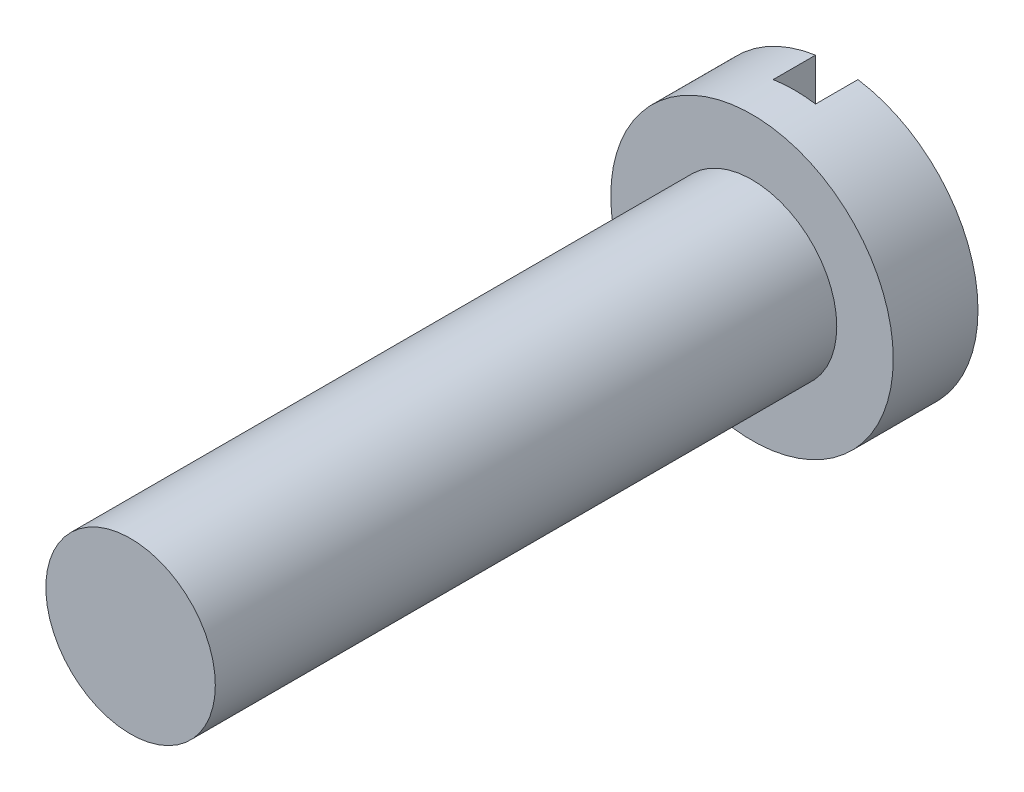
ISO-10303-21;
HEADER;
FILE_DESCRIPTION(('STEP AP214'),'2;1');
FILE_NAME('part.step','',(''),(''),'','','');
FILE_SCHEMA(('AUTOMOTIVE_DESIGN { 1 0 10303 214 1 1 1 1 }'));
ENDSEC;
DATA;
#1=APPLICATION_CONTEXT('core data for automotive mechanical design processes');
#2=APPLICATION_PROTOCOL_DEFINITION('international standard','automotive_design',2000,#1);
#3=PRODUCT_CONTEXT('',#1,'mechanical');
#4=PRODUCT('Part','Part','',(#3));
#5=PRODUCT_RELATED_PRODUCT_CATEGORY('part','',(#4));
#6=PRODUCT_DEFINITION_FORMATION('','',#4);
#7=PRODUCT_DEFINITION_CONTEXT('part definition',#1,'design');
#8=PRODUCT_DEFINITION('design','',#6,#7);
#9=PRODUCT_DEFINITION_SHAPE('','',#8);
#10=(LENGTH_UNIT() NAMED_UNIT(*) SI_UNIT(.MILLI.,.METRE.));
#11=(NAMED_UNIT(*) PLANE_ANGLE_UNIT() SI_UNIT($,.RADIAN.));
#12=(NAMED_UNIT(*) SI_UNIT($,.STERADIAN.) SOLID_ANGLE_UNIT());
#13=UNCERTAINTY_MEASURE_WITH_UNIT(LENGTH_MEASURE(1.E-05),#10,'distance_accuracy_value','');
#14=(GEOMETRIC_REPRESENTATION_CONTEXT(3) GLOBAL_UNCERTAINTY_ASSIGNED_CONTEXT((#13)) GLOBAL_UNIT_ASSIGNED_CONTEXT((#10,
#11,#12)) REPRESENTATION_CONTEXT('',''));
#15=CARTESIAN_POINT('',(0.,0.,0.));
#16=DIRECTION('',(0.,0.,1.));
#17=DIRECTION('',(1.,0.,0.));
#18=AXIS2_PLACEMENT_3D('',#15,#16,#17);
#19=CARTESIAN_POINT('',(0.,0.,-3.));
#20=DIRECTION('',(0.,0.,1.));
#21=DIRECTION('',(1.,0.,0.));
#22=AXIS2_PLACEMENT_3D('',#19,#20,#21);
#23=PLANE('',#22);
#24=CARTESIAN_POINT('',(0.,0.,-3.));
#25=DIRECTION('',(0.,0.,1.));
#26=DIRECTION('',(1.,0.,0.));
#27=AXIS2_PLACEMENT_3D('',#24,#25,#26);
#28=CIRCLE('',#27,5.);
#29=CARTESIAN_POINT('',(0.75,-4.9434299833213,-3.));
#30=VERTEX_POINT('',#29);
#31=CARTESIAN_POINT('',(0.75,4.9434299833213,-3.));
#32=VERTEX_POINT('',#31);
#33=EDGE_CURVE('E99',#30,#32,#28,.T.);
#34=ORIENTED_EDGE('',*,*,#33,.F.);
#35=DIRECTION('',(0.,1.,0.));
#36=VECTOR('',#35,1.);
#37=CARTESIAN_POINT('',(0.75,0.,-3.));
#38=LINE('',#37,#36);
#39=EDGE_CURVE('E86',#30,#32,#38,.T.);
#40=ORIENTED_EDGE('',*,*,#39,.T.);
#41=EDGE_LOOP('',(#34,#40));
#42=FACE_BOUND('',#41,.T.);
#43=ADVANCED_FACE('F38',(#42),#23,.F.);
#44=CARTESIAN_POINT('',(0.,0.,22.));
#45=DIRECTION('',(0.,0.,-1.));
#46=DIRECTION('',(-1.,0.,0.));
#47=AXIS2_PLACEMENT_3D('',#44,#45,#46);
#48=CYLINDRICAL_SURFACE('',#47,3.);
#49=CARTESIAN_POINT('',(0.,0.,22.));
#50=DIRECTION('',(0.,0.,1.));
#51=DIRECTION('',(1.,0.,0.));
#52=AXIS2_PLACEMENT_3D('',#49,#50,#51);
#53=CIRCLE('',#52,3.);
#54=CARTESIAN_POINT('',(3.,0.,22.));
#55=VERTEX_POINT('',#54);
#56=EDGE_CURVE('E87',#55,#55,#53,.T.);
#57=ORIENTED_EDGE('',*,*,#56,.F.);
#58=EDGE_LOOP('',(#57));
#59=FACE_BOUND('',#58,.T.);
#60=CARTESIAN_POINT('',(0.,0.,0.));
#61=DIRECTION('',(0.,0.,1.));
#62=DIRECTION('',(1.,0.,0.));
#63=AXIS2_PLACEMENT_3D('',#60,#61,#62);
#64=CIRCLE('',#63,3.);
#65=CARTESIAN_POINT('',(3.,0.,0.));
#66=VERTEX_POINT('',#65);
#67=EDGE_CURVE('E98',#66,#66,#64,.T.);
#68=ORIENTED_EDGE('',*,*,#67,.T.);
#69=EDGE_LOOP('',(#68));
#70=FACE_BOUND('',#69,.T.);
#71=ADVANCED_FACE('F40',(#59,#70),#48,.T.);
#72=CARTESIAN_POINT('',(0.,0.,22.));
#73=DIRECTION('',(0.,0.,1.));
#74=DIRECTION('',(1.,0.,0.));
#75=AXIS2_PLACEMENT_3D('',#72,#73,#74);
#76=PLANE('',#75);
#77=ORIENTED_EDGE('',*,*,#56,.T.);
#78=EDGE_LOOP('',(#77));
#79=FACE_BOUND('',#78,.T.);
#80=ADVANCED_FACE('F134',(#79),#76,.T.);
#81=CARTESIAN_POINT('',(0.,0.,0.));
#82=DIRECTION('',(0.,0.,1.));
#83=DIRECTION('',(1.,0.,0.));
#84=AXIS2_PLACEMENT_3D('',#81,#82,#83);
#85=PLANE('',#84);
#86=CARTESIAN_POINT('',(0.,0.,0.));
#87=DIRECTION('',(0.,0.,1.));
#88=DIRECTION('',(1.,0.,0.));
#89=AXIS2_PLACEMENT_3D('',#86,#87,#88);
#90=CIRCLE('',#89,5.);
#91=CARTESIAN_POINT('',(5.,0.,0.));
#92=VERTEX_POINT('',#91);
#93=EDGE_CURVE('E104',#92,#92,#90,.T.);
#94=ORIENTED_EDGE('',*,*,#93,.T.);
#95=EDGE_LOOP('',(#94));
#96=FACE_BOUND('',#95,.T.);
#97=ORIENTED_EDGE('',*,*,#67,.F.);
#98=EDGE_LOOP('',(#97));
#99=FACE_BOUND('',#98,.T.);
#100=ADVANCED_FACE('F137',(#96,#99),#85,.T.);
#101=CARTESIAN_POINT('',(0.,0.,-3.));
#102=DIRECTION('',(0.,0.,1.));
#103=DIRECTION('',(1.,0.,0.));
#104=AXIS2_PLACEMENT_3D('',#101,#102,#103);
#105=CYLINDRICAL_SURFACE('',#104,5.);
#106=DIRECTION('',(0.,0.,1.));
#107=VECTOR('',#106,1.);
#108=CARTESIAN_POINT('',(0.75,-4.9434299833213,-3.));
#109=LINE('',#108,#107);
#110=CARTESIAN_POINT('',(0.75,-4.9434299833213,-1.5));
#111=VERTEX_POINT('',#110);
#112=EDGE_CURVE('E61',#30,#111,#109,.T.);
#113=ORIENTED_EDGE('',*,*,#112,.F.);
#114=ORIENTED_EDGE('',*,*,#33,.T.);
#115=DIRECTION('',(0.,0.,1.));
#116=VECTOR('',#115,1.);
#117=CARTESIAN_POINT('',(0.75,4.9434299833213,-3.));
#118=LINE('',#117,#116);
#119=CARTESIAN_POINT('',(0.75,4.9434299833213,-1.5));
#120=VERTEX_POINT('',#119);
#121=EDGE_CURVE('E107',#120,#32,#118,.F.);
#122=ORIENTED_EDGE('',*,*,#121,.F.);
#123=CARTESIAN_POINT('',(0.,0.,-1.5));
#124=DIRECTION('',(0.,0.,-1.));
#125=DIRECTION('',(-1.,0.,0.));
#126=AXIS2_PLACEMENT_3D('',#123,#124,#125);
#127=CIRCLE('',#126,5.);
#128=CARTESIAN_POINT('',(-0.75,4.9434299833213,-1.5));
#129=VERTEX_POINT('',#128);
#130=EDGE_CURVE('E42',#120,#129,#127,.F.);
#131=ORIENTED_EDGE('',*,*,#130,.T.);
#132=DIRECTION('',(0.,0.,1.));
#133=VECTOR('',#132,1.);
#134=CARTESIAN_POINT('',(-0.75,4.9434299833213,-3.));
#135=LINE('',#134,#133);
#136=CARTESIAN_POINT('',(-0.75,4.9434299833213,-3.));
#137=VERTEX_POINT('',#136);
#138=EDGE_CURVE('E81',#137,#129,#135,.T.);
#139=ORIENTED_EDGE('',*,*,#138,.F.);
#140=CARTESIAN_POINT('',(-0.75,-4.9434299833213,-3.));
#141=VERTEX_POINT('',#140);
#142=EDGE_CURVE('E93',#137,#141,#28,.T.);
#143=ORIENTED_EDGE('',*,*,#142,.T.);
#144=DIRECTION('',(0.,0.,1.));
#145=VECTOR('',#144,1.);
#146=CARTESIAN_POINT('',(-0.75,-4.9434299833213,-3.));
#147=LINE('',#146,#145);
#148=CARTESIAN_POINT('',(-0.75,-4.9434299833213,-1.5));
#149=VERTEX_POINT('',#148);
#150=EDGE_CURVE('E53',#149,#141,#147,.F.);
#151=ORIENTED_EDGE('',*,*,#150,.F.);
#152=EDGE_CURVE('E11',#149,#111,#127,.F.);
#153=ORIENTED_EDGE('',*,*,#152,.T.);
#154=EDGE_LOOP('',(#113,#114,#122,#131,#139,#143,#151,#153));
#155=FACE_BOUND('',#154,.T.);
#156=ORIENTED_EDGE('',*,*,#93,.F.);
#157=EDGE_LOOP('',(#156));
#158=FACE_BOUND('',#157,.T.);
#159=ADVANCED_FACE('F91',(#155,#158),#105,.T.);
#160=ORIENTED_EDGE('',*,*,#142,.F.);
#161=DIRECTION('',(0.,-1.,0.));
#162=VECTOR('',#161,1.);
#163=CARTESIAN_POINT('',(-0.75,0.,-3.));
#164=LINE('',#163,#162);
#165=EDGE_CURVE('E78',#137,#141,#164,.T.);
#166=ORIENTED_EDGE('',*,*,#165,.T.);
#167=EDGE_LOOP('',(#160,#166));
#168=FACE_BOUND('',#167,.T.);
#169=ADVANCED_FACE('F97',(#168),#23,.F.);
#170=CARTESIAN_POINT('',(0.75,-5.,-1.5));
#171=DIRECTION('',(1.,0.,0.));
#172=DIRECTION('',(0.,0.,-1.));
#173=AXIS2_PLACEMENT_3D('',#170,#171,#172);
#174=PLANE('',#173);
#175=ORIENTED_EDGE('',*,*,#121,.T.);
#176=ORIENTED_EDGE('',*,*,#39,.F.);
#177=ORIENTED_EDGE('',*,*,#112,.T.);
#178=DIRECTION('',(0.,-1.,0.));
#179=VECTOR('',#178,1.);
#180=CARTESIAN_POINT('',(0.75,-5.,-1.5));
#181=LINE('',#180,#179);
#182=EDGE_CURVE('E118',#120,#111,#181,.T.);
#183=ORIENTED_EDGE('',*,*,#182,.F.);
#184=EDGE_LOOP('',(#175,#176,#177,#183));
#185=FACE_BOUND('',#184,.T.);
#186=ADVANCED_FACE('F121',(#185),#174,.F.);
#187=CARTESIAN_POINT('',(-0.75,-5.,-1.5));
#188=DIRECTION('',(-1.,0.,0.));
#189=DIRECTION('',(0.,0.,1.));
#190=AXIS2_PLACEMENT_3D('',#187,#188,#189);
#191=PLANE('',#190);
#192=ORIENTED_EDGE('',*,*,#150,.T.);
#193=ORIENTED_EDGE('',*,*,#165,.F.);
#194=ORIENTED_EDGE('',*,*,#138,.T.);
#195=DIRECTION('',(0.,1.,0.));
#196=VECTOR('',#195,1.);
#197=CARTESIAN_POINT('',(-0.75,-5.,-1.5));
#198=LINE('',#197,#196);
#199=EDGE_CURVE('E95',#149,#129,#198,.T.);
#200=ORIENTED_EDGE('',*,*,#199,.F.);
#201=EDGE_LOOP('',(#192,#193,#194,#200));
#202=FACE_BOUND('',#201,.T.);
#203=ADVANCED_FACE('F80',(#202),#191,.F.);
#204=CARTESIAN_POINT('',(0.,0.,-1.5));
#205=DIRECTION('',(0.,0.,-1.));
#206=DIRECTION('',(-1.,0.,0.));
#207=AXIS2_PLACEMENT_3D('',#204,#205,#206);
#208=PLANE('',#207);
#209=ORIENTED_EDGE('',*,*,#199,.T.);
#210=ORIENTED_EDGE('',*,*,#130,.F.);
#211=ORIENTED_EDGE('',*,*,#182,.T.);
#212=ORIENTED_EDGE('',*,*,#152,.F.);
#213=EDGE_LOOP('',(#209,#210,#211,#212));
#214=FACE_BOUND('',#213,.T.);
#215=ADVANCED_FACE('F120',(#214),#208,.T.);
#216=CLOSED_SHELL('',(#43,#71,#80,#100,#159,#169,#186,#203,#215));
#217=MANIFOLD_SOLID_BREP('B2',#216);
#218=ADVANCED_BREP_SHAPE_REPRESENTATION('',(#18,#217),#14);
#219=SHAPE_DEFINITION_REPRESENTATION(#9,#218);
ENDSEC;
END-ISO-10303-21;
